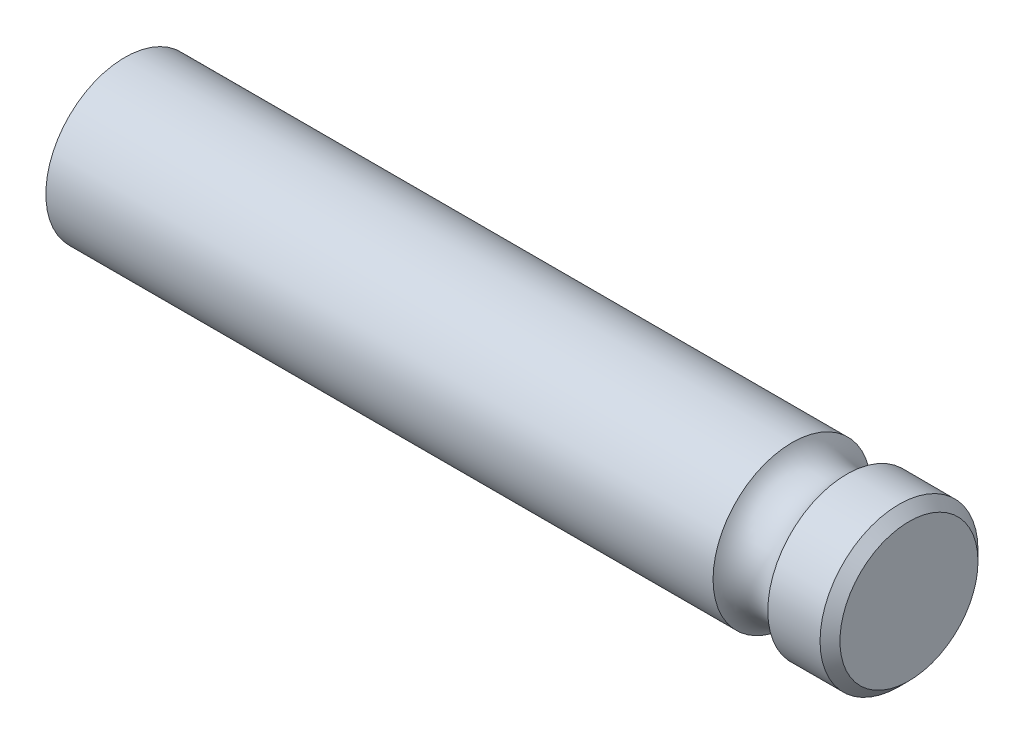
ISO-10303-21;
HEADER;
FILE_DESCRIPTION(('STEP AP214'),'2;1');
FILE_NAME('part.step','',(''),(''),'','','');
FILE_SCHEMA(('AUTOMOTIVE_DESIGN { 1 0 10303 214 1 1 1 1 }'));
ENDSEC;
DATA;
#1=APPLICATION_CONTEXT('core data for automotive mechanical design processes');
#2=APPLICATION_PROTOCOL_DEFINITION('international standard','automotive_design',2000,#1);
#3=PRODUCT_CONTEXT('',#1,'mechanical');
#4=PRODUCT('Part','Part','',(#3));
#5=PRODUCT_RELATED_PRODUCT_CATEGORY('part','',(#4));
#6=PRODUCT_DEFINITION_FORMATION('','',#4);
#7=PRODUCT_DEFINITION_CONTEXT('part definition',#1,'design');
#8=PRODUCT_DEFINITION('design','',#6,#7);
#9=PRODUCT_DEFINITION_SHAPE('','',#8);
#10=(LENGTH_UNIT() NAMED_UNIT(*) SI_UNIT(.MILLI.,.METRE.));
#11=(NAMED_UNIT(*) PLANE_ANGLE_UNIT() SI_UNIT($,.RADIAN.));
#12=(NAMED_UNIT(*) SI_UNIT($,.STERADIAN.) SOLID_ANGLE_UNIT());
#13=UNCERTAINTY_MEASURE_WITH_UNIT(LENGTH_MEASURE(1.E-05),#10,'distance_accuracy_value','');
#14=(GEOMETRIC_REPRESENTATION_CONTEXT(3) GLOBAL_UNCERTAINTY_ASSIGNED_CONTEXT((#13)) GLOBAL_UNIT_ASSIGNED_CONTEXT((#10,
#11,#12)) REPRESENTATION_CONTEXT('',''));
#15=CARTESIAN_POINT('',(0.,0.,0.));
#16=DIRECTION('',(0.,0.,1.));
#17=DIRECTION('',(1.,0.,0.));
#18=AXIS2_PLACEMENT_3D('',#15,#16,#17);
#19=CARTESIAN_POINT('',(78.8,0.,0.));
#20=DIRECTION('',(-1.,0.,0.));
#21=DIRECTION('',(0.,0.,1.));
#22=AXIS2_PLACEMENT_3D('',#19,#20,#21);
#23=CYLINDRICAL_SURFACE('',#22,7.9375);
#24=CARTESIAN_POINT('',(0.,0.,0.));
#25=DIRECTION('',(1.,0.,0.));
#26=DIRECTION('',(0.,0.,-1.));
#27=AXIS2_PLACEMENT_3D('',#24,#25,#26);
#28=CIRCLE('',#27,7.9375);
#29=CARTESIAN_POINT('',(0.,0.,-7.9375));
#30=VERTEX_POINT('',#29);
#31=EDGE_CURVE('E46',#30,#30,#28,.T.);
#32=ORIENTED_EDGE('',*,*,#31,.T.);
#33=EDGE_LOOP('',(#32));
#34=FACE_BOUND('',#33,.T.);
#35=CARTESIAN_POINT('',(67.0503693429844,0.,0.));
#36=DIRECTION('',(1.,0.,0.));
#37=DIRECTION('',(0.,0.,-1.));
#38=AXIS2_PLACEMENT_3D('',#35,#36,#37);
#39=CIRCLE('',#38,7.9375);
#40=CARTESIAN_POINT('',(67.0503693429844,0.,-7.9375));
#41=VERTEX_POINT('',#40);
#42=EDGE_CURVE('E50',#41,#41,#39,.T.);
#43=ORIENTED_EDGE('',*,*,#42,.F.);
#44=EDGE_LOOP('',(#43));
#45=FACE_BOUND('',#44,.T.);
#46=ADVANCED_FACE('F35',(#34,#45),#23,.T.);
#47=CARTESIAN_POINT('',(0.,0.,0.));
#48=DIRECTION('',(1.,0.,0.));
#49=DIRECTION('',(0.,0.,-1.));
#50=AXIS2_PLACEMENT_3D('',#47,#48,#49);
#51=PLANE('',#50);
#52=ORIENTED_EDGE('',*,*,#31,.F.);
#53=EDGE_LOOP('',(#52));
#54=FACE_BOUND('',#53,.T.);
#55=ADVANCED_FACE('F73',(#54),#51,.F.);
#56=CARTESIAN_POINT('',(69.8,0.,0.));
#57=DIRECTION('',(-1.,0.,0.));
#58=DIRECTION('',(0.,0.,1.));
#59=AXIS2_PLACEMENT_3D('',#56,#57,#58);
#60=TOROIDAL_SURFACE('',#59,9.525,3.175);
#61=CARTESIAN_POINT('',(72.5496306570156,0.,0.));
#62=DIRECTION('',(-1.,0.,0.));
#63=DIRECTION('',(0.,0.,1.));
#64=AXIS2_PLACEMENT_3D('',#61,#62,#63);
#65=CIRCLE('',#64,7.9375);
#66=CARTESIAN_POINT('',(72.5496306570156,0.,7.9375));
#67=VERTEX_POINT('',#66);
#68=EDGE_CURVE('E55',#67,#67,#65,.T.);
#69=ORIENTED_EDGE('',*,*,#68,.T.);
#70=EDGE_LOOP('',(#69));
#71=FACE_BOUND('',#70,.T.);
#72=ORIENTED_EDGE('',*,*,#42,.T.);
#73=EDGE_LOOP('',(#72));
#74=FACE_BOUND('',#73,.T.);
#75=ADVANCED_FACE('F59',(#71,#74),#60,.F.);
#76=CARTESIAN_POINT('',(78.8,0.,0.));
#77=DIRECTION('',(1.,0.,0.));
#78=DIRECTION('',(0.,0.,-1.));
#79=AXIS2_PLACEMENT_3D('',#76,#77,#78);
#80=PLANE('',#79);
#81=CARTESIAN_POINT('',(78.8,0.,0.));
#82=DIRECTION('',(1.,0.,0.));
#83=DIRECTION('',(0.,0.,-1.));
#84=AXIS2_PLACEMENT_3D('',#81,#82,#83);
#85=CIRCLE('',#84,6.9375);
#86=CARTESIAN_POINT('',(78.8,0.,-6.9375));
#87=VERTEX_POINT('',#86);
#88=EDGE_CURVE('E42',#87,#87,#85,.T.);
#89=ORIENTED_EDGE('',*,*,#88,.T.);
#90=EDGE_LOOP('',(#89));
#91=FACE_BOUND('',#90,.T.);
#92=ADVANCED_FACE('F64',(#91),#80,.T.);
#93=CARTESIAN_POINT('',(77.8,0.,0.));
#94=DIRECTION('',(1.,0.,0.));
#95=DIRECTION('',(0.,0.,-1.));
#96=AXIS2_PLACEMENT_3D('',#93,#94,#95);
#97=CIRCLE('',#96,7.9375);
#98=CARTESIAN_POINT('',(77.8,0.,-7.9375));
#99=VERTEX_POINT('',#98);
#100=EDGE_CURVE('E10',#99,#99,#97,.F.);
#101=ORIENTED_EDGE('',*,*,#100,.T.);
#102=EDGE_LOOP('',(#101));
#103=FACE_BOUND('',#102,.T.);
#104=ORIENTED_EDGE('',*,*,#68,.F.);
#105=EDGE_LOOP('',(#104));
#106=FACE_BOUND('',#105,.T.);
#107=ADVANCED_FACE('F62',(#103,#106),#23,.T.);
#108=CARTESIAN_POINT('',(78.8,0.,0.));
#109=DIRECTION('',(-1.,0.,0.));
#110=DIRECTION('',(0.,0.,1.));
#111=AXIS2_PLACEMENT_3D('',#108,#109,#110);
#112=CONICAL_SURFACE('',#111,6.9375,0.785398163397448);
#113=ORIENTED_EDGE('',*,*,#100,.F.);
#114=EDGE_LOOP('',(#113));
#115=FACE_BOUND('',#114,.T.);
#116=ORIENTED_EDGE('',*,*,#88,.F.);
#117=EDGE_LOOP('',(#116));
#118=FACE_BOUND('',#117,.T.);
#119=ADVANCED_FACE('F37',(#115,#118),#112,.T.);
#120=CLOSED_SHELL('',(#46,#55,#75,#92,#107,#119));
#121=MANIFOLD_SOLID_BREP('B2',#120);
#122=ADVANCED_BREP_SHAPE_REPRESENTATION('',(#18,#121),#14);
#123=SHAPE_DEFINITION_REPRESENTATION(#9,#122);
ENDSEC;
END-ISO-10303-21;
